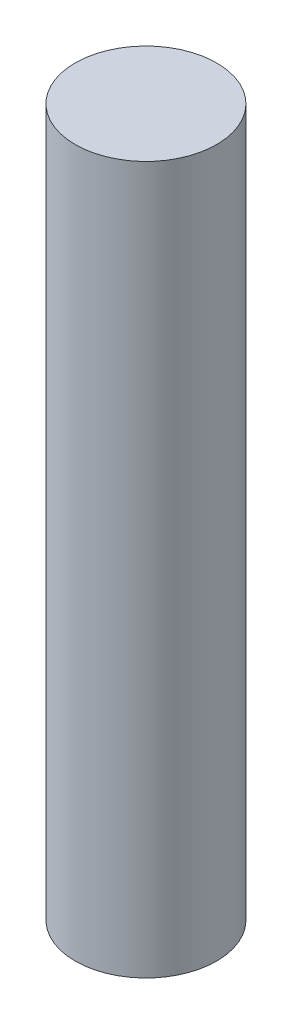
ISO-10303-21;
HEADER;
FILE_DESCRIPTION(('STEP AP214'),'2;1');
FILE_NAME('part.step','',(''),(''),'','','');
FILE_SCHEMA(('AUTOMOTIVE_DESIGN { 1 0 10303 214 1 1 1 1 }'));
ENDSEC;
DATA;
#1=APPLICATION_CONTEXT('core data for automotive mechanical design processes');
#2=APPLICATION_PROTOCOL_DEFINITION('international standard','automotive_design',2000,#1);
#3=PRODUCT_CONTEXT('',#1,'mechanical');
#4=PRODUCT('Part','Part','',(#3));
#5=PRODUCT_RELATED_PRODUCT_CATEGORY('part','',(#4));
#6=PRODUCT_DEFINITION_FORMATION('','',#4);
#7=PRODUCT_DEFINITION_CONTEXT('part definition',#1,'design');
#8=PRODUCT_DEFINITION('design','',#6,#7);
#9=PRODUCT_DEFINITION_SHAPE('','',#8);
#10=(LENGTH_UNIT() NAMED_UNIT(*) SI_UNIT(.MILLI.,.METRE.));
#11=(NAMED_UNIT(*) PLANE_ANGLE_UNIT() SI_UNIT($,.RADIAN.));
#12=(NAMED_UNIT(*) SI_UNIT($,.STERADIAN.) SOLID_ANGLE_UNIT());
#13=UNCERTAINTY_MEASURE_WITH_UNIT(LENGTH_MEASURE(1.E-05),#10,'distance_accuracy_value','');
#14=(GEOMETRIC_REPRESENTATION_CONTEXT(3) GLOBAL_UNCERTAINTY_ASSIGNED_CONTEXT((#13)) GLOBAL_UNIT_ASSIGNED_CONTEXT((#10,
#11,#12)) REPRESENTATION_CONTEXT('',''));
#15=CARTESIAN_POINT('',(0.,0.,0.));
#16=DIRECTION('',(0.,0.,1.));
#17=DIRECTION('',(1.,0.,0.));
#18=AXIS2_PLACEMENT_3D('',#15,#16,#17);
#19=CARTESIAN_POINT('',(0.,31.75,0.));
#20=DIRECTION('',(0.,-1.,0.));
#21=DIRECTION('',(0.,0.,-1.));
#22=AXIS2_PLACEMENT_3D('',#19,#20,#21);
#23=CYLINDRICAL_SURFACE('',#22,3.175);
#24=CARTESIAN_POINT('',(0.,31.75,0.));
#25=DIRECTION('',(0.,1.,0.));
#26=DIRECTION('',(0.,0.,1.));
#27=AXIS2_PLACEMENT_3D('',#24,#25,#26);
#28=CIRCLE('',#27,3.175);
#29=CARTESIAN_POINT('',(0.,31.75,3.175));
#30=VERTEX_POINT('',#29);
#31=EDGE_CURVE('E10',#30,#30,#28,.T.);
#32=ORIENTED_EDGE('',*,*,#31,.F.);
#33=EDGE_LOOP('',(#32));
#34=FACE_BOUND('',#33,.T.);
#35=CARTESIAN_POINT('',(0.,0.,0.));
#36=DIRECTION('',(0.,1.,0.));
#37=DIRECTION('',(0.,0.,1.));
#38=AXIS2_PLACEMENT_3D('',#35,#36,#37);
#39=CIRCLE('',#38,3.175);
#40=CARTESIAN_POINT('',(0.,0.,3.175));
#41=VERTEX_POINT('',#40);
#42=EDGE_CURVE('E34',#41,#41,#39,.T.);
#43=ORIENTED_EDGE('',*,*,#42,.T.);
#44=EDGE_LOOP('',(#43));
#45=FACE_BOUND('',#44,.T.);
#46=ADVANCED_FACE('F31',(#34,#45),#23,.T.);
#47=CARTESIAN_POINT('',(0.,31.75,0.));
#48=DIRECTION('',(0.,1.,0.));
#49=DIRECTION('',(0.,0.,1.));
#50=AXIS2_PLACEMENT_3D('',#47,#48,#49);
#51=PLANE('',#50);
#52=ORIENTED_EDGE('',*,*,#31,.T.);
#53=EDGE_LOOP('',(#52));
#54=FACE_BOUND('',#53,.T.);
#55=ADVANCED_FACE('F46',(#54),#51,.T.);
#56=CARTESIAN_POINT('',(0.,0.,0.));
#57=DIRECTION('',(0.,1.,0.));
#58=DIRECTION('',(0.,0.,1.));
#59=AXIS2_PLACEMENT_3D('',#56,#57,#58);
#60=PLANE('',#59);
#61=ORIENTED_EDGE('',*,*,#42,.F.);
#62=EDGE_LOOP('',(#61));
#63=FACE_BOUND('',#62,.T.);
#64=ADVANCED_FACE('F44',(#63),#60,.F.);
#65=CLOSED_SHELL('',(#46,#55,#64));
#66=MANIFOLD_SOLID_BREP('B2',#65);
#67=ADVANCED_BREP_SHAPE_REPRESENTATION('',(#18,#66),#14);
#68=SHAPE_DEFINITION_REPRESENTATION(#9,#67);
ENDSEC;
END-ISO-10303-21;
